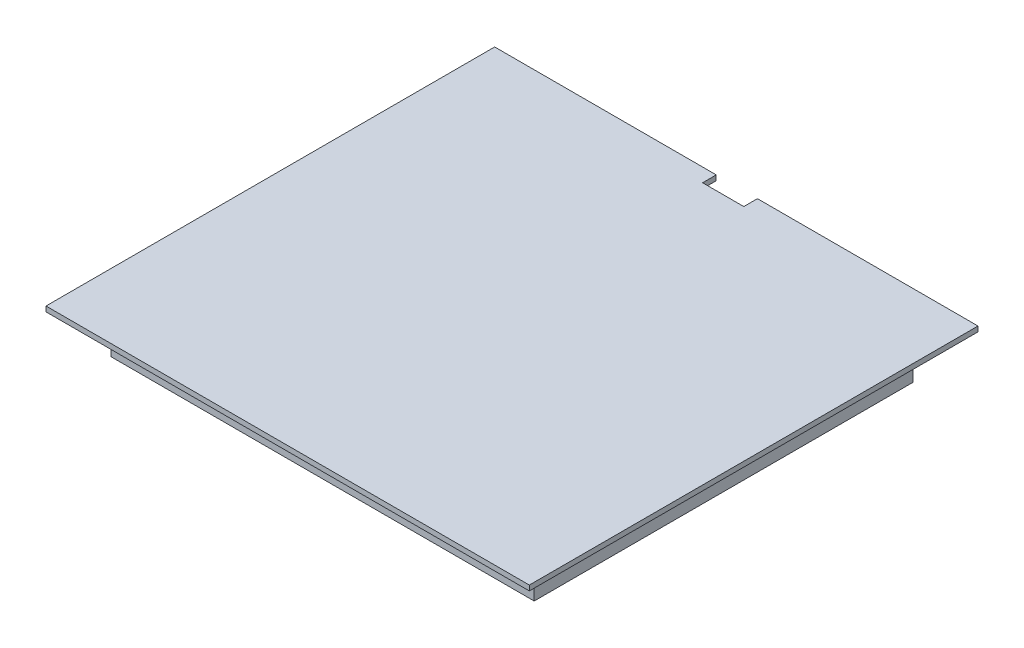
ISO-10303-21;
HEADER;
FILE_DESCRIPTION(('STEP AP214'),'2;1');
FILE_NAME('part.step','',(''),(''),'','','');
FILE_SCHEMA(('AUTOMOTIVE_DESIGN { 1 0 10303 214 1 1 1 1 }'));
ENDSEC;
DATA;
#1=APPLICATION_CONTEXT('core data for automotive mechanical design processes');
#2=APPLICATION_PROTOCOL_DEFINITION('international standard','automotive_design',2000,#1);
#3=PRODUCT_CONTEXT('',#1,'mechanical');
#4=PRODUCT('Part','Part','',(#3));
#5=PRODUCT_RELATED_PRODUCT_CATEGORY('part','',(#4));
#6=PRODUCT_DEFINITION_FORMATION('','',#4);
#7=PRODUCT_DEFINITION_CONTEXT('part definition',#1,'design');
#8=PRODUCT_DEFINITION('design','',#6,#7);
#9=PRODUCT_DEFINITION_SHAPE('','',#8);
#10=(LENGTH_UNIT() NAMED_UNIT(*) SI_UNIT(.MILLI.,.METRE.));
#11=(NAMED_UNIT(*) PLANE_ANGLE_UNIT() SI_UNIT($,.RADIAN.));
#12=(NAMED_UNIT(*) SI_UNIT($,.STERADIAN.) SOLID_ANGLE_UNIT());
#13=UNCERTAINTY_MEASURE_WITH_UNIT(LENGTH_MEASURE(1.E-05),#10,'distance_accuracy_value','');
#14=(GEOMETRIC_REPRESENTATION_CONTEXT(3) GLOBAL_UNCERTAINTY_ASSIGNED_CONTEXT((#13)) GLOBAL_UNIT_ASSIGNED_CONTEXT((#10,
#11,#12)) REPRESENTATION_CONTEXT('',''));
#15=CARTESIAN_POINT('',(0.,0.,0.));
#16=DIRECTION('',(0.,0.,1.));
#17=DIRECTION('',(1.,0.,0.));
#18=AXIS2_PLACEMENT_3D('',#15,#16,#17);
#19=CARTESIAN_POINT('',(-32.5832733447217,-6.35,-29.1673675004266));
#20=DIRECTION('',(1.,0.,0.));
#21=DIRECTION('',(0.,0.,-1.));
#22=AXIS2_PLACEMENT_3D('',#19,#20,#21);
#23=PLANE('',#22);
#24=DIRECTION('',(0.,0.,-1.));
#25=VECTOR('',#24,1.);
#26=CARTESIAN_POINT('',(-32.5832733447217,0.,-29.1673675004266));
#27=LINE('',#26,#25);
#28=CARTESIAN_POINT('',(-32.5832733447217,0.,29.1673675004266));
#29=VERTEX_POINT('',#28);
#30=CARTESIAN_POINT('',(-32.5832733447217,0.,-29.1673675004266));
#31=VERTEX_POINT('',#30);
#32=EDGE_CURVE('E107',#29,#31,#27,.T.);
#33=ORIENTED_EDGE('',*,*,#32,.T.);
#34=DIRECTION('',(0.,1.,0.));
#35=VECTOR('',#34,1.);
#36=CARTESIAN_POINT('',(-32.5832733447217,-6.35,-29.1673675004266));
#37=LINE('',#36,#35);
#38=CARTESIAN_POINT('',(-32.5832733447217,-6.35,-29.1673675004266));
#39=VERTEX_POINT('',#38);
#40=EDGE_CURVE('E12',#39,#31,#37,.T.);
#41=ORIENTED_EDGE('',*,*,#40,.F.);
#42=DIRECTION('',(0.,0.,-1.));
#43=VECTOR('',#42,1.);
#44=CARTESIAN_POINT('',(-32.5832733447217,-6.35,-29.1673675004266));
#45=LINE('',#44,#43);
#46=CARTESIAN_POINT('',(-32.5832733447217,-6.35,29.1673675004266));
#47=VERTEX_POINT('',#46);
#48=EDGE_CURVE('E95',#47,#39,#45,.T.);
#49=ORIENTED_EDGE('',*,*,#48,.F.);
#50=DIRECTION('',(0.,1.,0.));
#51=VECTOR('',#50,1.);
#52=CARTESIAN_POINT('',(-32.5832733447217,-6.35,29.1673675004266));
#53=LINE('',#52,#51);
#54=EDGE_CURVE('E103',#47,#29,#53,.T.);
#55=ORIENTED_EDGE('',*,*,#54,.T.);
#56=EDGE_LOOP('',(#33,#41,#49,#55));
#57=FACE_BOUND('',#56,.T.);
#58=ADVANCED_FACE('F44',(#57),#23,.F.);
#59=CARTESIAN_POINT('',(32.5832733447217,-6.35,-29.1673675004266));
#60=DIRECTION('',(0.,0.,1.));
#61=DIRECTION('',(1.,0.,0.));
#62=AXIS2_PLACEMENT_3D('',#59,#60,#61);
#63=PLANE('',#62);
#64=DIRECTION('',(1.,0.,0.));
#65=VECTOR('',#64,1.);
#66=CARTESIAN_POINT('',(32.5832733447217,0.,-29.1673675004266));
#67=LINE('',#66,#65);
#68=CARTESIAN_POINT('',(32.5832733447217,0.,-29.1673675004266));
#69=VERTEX_POINT('',#68);
#70=EDGE_CURVE('E99',#31,#69,#67,.T.);
#71=ORIENTED_EDGE('',*,*,#70,.T.);
#72=DIRECTION('',(0.,1.,0.));
#73=VECTOR('',#72,1.);
#74=CARTESIAN_POINT('',(32.5832733447217,-6.35,-29.1673675004266));
#75=LINE('',#74,#73);
#76=CARTESIAN_POINT('',(32.5832733447217,-6.35,-29.1673675004266));
#77=VERTEX_POINT('',#76);
#78=EDGE_CURVE('E52',#77,#69,#75,.T.);
#79=ORIENTED_EDGE('',*,*,#78,.F.);
#80=DIRECTION('',(1.,0.,0.));
#81=VECTOR('',#80,1.);
#82=CARTESIAN_POINT('',(32.5832733447217,-6.35,-29.1673675004266));
#83=LINE('',#82,#81);
#84=EDGE_CURVE('E90',#39,#77,#83,.T.);
#85=ORIENTED_EDGE('',*,*,#84,.F.);
#86=ORIENTED_EDGE('',*,*,#40,.T.);
#87=EDGE_LOOP('',(#71,#79,#85,#86));
#88=FACE_BOUND('',#87,.T.);
#89=ADVANCED_FACE('F98',(#88),#63,.F.);
#90=CARTESIAN_POINT('',(32.5832733447217,-6.35,-29.1673675004266));
#91=DIRECTION('',(-1.,0.,0.));
#92=DIRECTION('',(0.,0.,1.));
#93=AXIS2_PLACEMENT_3D('',#90,#91,#92);
#94=PLANE('',#93);
#95=DIRECTION('',(0.,0.,1.));
#96=VECTOR('',#95,1.);
#97=CARTESIAN_POINT('',(32.5832733447217,0.,-29.1673675004266));
#98=LINE('',#97,#96);
#99=CARTESIAN_POINT('',(32.5832733447217,0.,29.1673675004266));
#100=VERTEX_POINT('',#99);
#101=EDGE_CURVE('E77',#69,#100,#98,.T.);
#102=ORIENTED_EDGE('',*,*,#101,.T.);
#103=DIRECTION('',(0.,1.,0.));
#104=VECTOR('',#103,1.);
#105=CARTESIAN_POINT('',(32.5832733447217,-6.35,29.1673675004266));
#106=LINE('',#105,#104);
#107=CARTESIAN_POINT('',(32.5832733447217,-6.35,29.1673675004266));
#108=VERTEX_POINT('',#107);
#109=EDGE_CURVE('E100',#108,#100,#106,.T.);
#110=ORIENTED_EDGE('',*,*,#109,.F.);
#111=DIRECTION('',(0.,0.,1.));
#112=VECTOR('',#111,1.);
#113=CARTESIAN_POINT('',(32.5832733447217,-6.35,-29.1673675004266));
#114=LINE('',#113,#112);
#115=EDGE_CURVE('E93',#77,#108,#114,.T.);
#116=ORIENTED_EDGE('',*,*,#115,.F.);
#117=ORIENTED_EDGE('',*,*,#78,.T.);
#118=EDGE_LOOP('',(#102,#110,#116,#117));
#119=FACE_BOUND('',#118,.T.);
#120=ADVANCED_FACE('F101',(#119),#94,.F.);
#121=CARTESIAN_POINT('',(32.5832733447217,-6.35,29.1673675004266));
#122=DIRECTION('',(0.,0.,-1.));
#123=DIRECTION('',(-1.,0.,0.));
#124=AXIS2_PLACEMENT_3D('',#121,#122,#123);
#125=PLANE('',#124);
#126=DIRECTION('',(-1.,0.,0.));
#127=VECTOR('',#126,1.);
#128=CARTESIAN_POINT('',(32.5832733447217,0.,29.1673675004266));
#129=LINE('',#128,#127);
#130=EDGE_CURVE('E83',#100,#29,#129,.T.);
#131=ORIENTED_EDGE('',*,*,#130,.T.);
#132=ORIENTED_EDGE('',*,*,#54,.F.);
#133=DIRECTION('',(-1.,0.,0.));
#134=VECTOR('',#133,1.);
#135=CARTESIAN_POINT('',(32.5832733447217,-6.35,29.1673675004266));
#136=LINE('',#135,#134);
#137=EDGE_CURVE('E60',#108,#47,#136,.T.);
#138=ORIENTED_EDGE('',*,*,#137,.F.);
#139=ORIENTED_EDGE('',*,*,#109,.T.);
#140=EDGE_LOOP('',(#131,#132,#138,#139));
#141=FACE_BOUND('',#140,.T.);
#142=ADVANCED_FACE('F114',(#141),#125,.F.);
#143=CARTESIAN_POINT('',(0.,-6.35,0.));
#144=DIRECTION('',(0.,-1.,0.));
#145=DIRECTION('',(0.,0.,-1.));
#146=AXIS2_PLACEMENT_3D('',#143,#144,#145);
#147=PLANE('',#146);
#148=ORIENTED_EDGE('',*,*,#48,.T.);
#149=ORIENTED_EDGE('',*,*,#84,.T.);
#150=ORIENTED_EDGE('',*,*,#115,.T.);
#151=ORIENTED_EDGE('',*,*,#137,.T.);
#152=EDGE_LOOP('',(#148,#149,#150,#151));
#153=FACE_BOUND('',#152,.T.);
#154=ADVANCED_FACE('F91',(#153),#147,.T.);
#155=CARTESIAN_POINT('',(0.,0.,0.));
#156=DIRECTION('',(0.,-1.,0.));
#157=DIRECTION('',(0.,0.,-1.));
#158=AXIS2_PLACEMENT_3D('',#155,#156,#157);
#159=PLANE('',#158);
#160=ORIENTED_EDGE('',*,*,#32,.F.);
#161=ORIENTED_EDGE('',*,*,#130,.F.);
#162=ORIENTED_EDGE('',*,*,#101,.F.);
#163=ORIENTED_EDGE('',*,*,#70,.F.);
#164=EDGE_LOOP('',(#160,#161,#162,#163));
#165=FACE_BOUND('',#164,.T.);
#166=ADVANCED_FACE('F117',(#165),#159,.F.);
#167=CLOSED_SHELL('',(#58,#89,#120,#142,#154,#166));
#168=MANIFOLD_SOLID_BREP('B2',#167);
#169=CARTESIAN_POINT('',(37.211,0.7874,-34.544));
#170=DIRECTION('',(0.,0.,1.));
#171=DIRECTION('',(1.,0.,0.));
#172=AXIS2_PLACEMENT_3D('',#169,#170,#171);
#173=PLANE('',#172);
#174=DIRECTION('',(-1.,0.,0.));
#175=VECTOR('',#174,1.);
#176=CARTESIAN_POINT('',(37.211,0.7874,-34.544));
#177=LINE('',#176,#175);
#178=CARTESIAN_POINT('',(-3.09421520034433,0.7874,-34.544));
#179=VERTEX_POINT('',#178);
#180=CARTESIAN_POINT('',(-37.211,0.7874,-34.544));
#181=VERTEX_POINT('',#180);
#182=EDGE_CURVE('E191',#179,#181,#177,.T.);
#183=ORIENTED_EDGE('',*,*,#182,.F.);
#184=DIRECTION('',(0.,1.,0.));
#185=VECTOR('',#184,1.);
#186=CARTESIAN_POINT('',(-3.09421520034433,-5.5626,-34.544));
#187=LINE('',#186,#185);
#188=CARTESIAN_POINT('',(-3.09421520034433,0.,-34.544));
#189=VERTEX_POINT('',#188);
#190=EDGE_CURVE('E254',#189,#179,#187,.T.);
#191=ORIENTED_EDGE('',*,*,#190,.F.);
#192=DIRECTION('',(-1.,0.,0.));
#193=VECTOR('',#192,1.);
#194=CARTESIAN_POINT('',(37.211,0.,-34.544));
#195=LINE('',#194,#193);
#196=CARTESIAN_POINT('',(-37.211,0.,-34.544));
#197=VERTEX_POINT('',#196);
#198=EDGE_CURVE('E213',#189,#197,#195,.T.);
#199=ORIENTED_EDGE('',*,*,#198,.T.);
#200=DIRECTION('',(0.,-1.,0.));
#201=VECTOR('',#200,1.);
#202=CARTESIAN_POINT('',(-37.211,0.7874,-34.544));
#203=LINE('',#202,#201);
#204=EDGE_CURVE('E275',#181,#197,#203,.T.);
#205=ORIENTED_EDGE('',*,*,#204,.F.);
#206=EDGE_LOOP('',(#183,#191,#199,#205));
#207=FACE_BOUND('',#206,.T.);
#208=ADVANCED_FACE('F167',(#207),#173,.F.);
#209=CARTESIAN_POINT('',(-37.211,0.7874,34.544));
#210=DIRECTION('',(1.,0.,0.));
#211=DIRECTION('',(0.,0.,-1.));
#212=AXIS2_PLACEMENT_3D('',#209,#210,#211);
#213=PLANE('',#212);
#214=DIRECTION('',(0.,0.,1.));
#215=VECTOR('',#214,1.);
#216=CARTESIAN_POINT('',(-37.211,0.,34.544));
#217=LINE('',#216,#215);
#218=CARTESIAN_POINT('',(-37.211,0.,34.544));
#219=VERTEX_POINT('',#218);
#220=EDGE_CURVE('E262',#197,#219,#217,.T.);
#221=ORIENTED_EDGE('',*,*,#220,.T.);
#222=DIRECTION('',(0.,-1.,0.));
#223=VECTOR('',#222,1.);
#224=CARTESIAN_POINT('',(-37.211,0.7874,34.544));
#225=LINE('',#224,#223);
#226=CARTESIAN_POINT('',(-37.211,0.7874,34.544));
#227=VERTEX_POINT('',#226);
#228=EDGE_CURVE('E291',#227,#219,#225,.T.);
#229=ORIENTED_EDGE('',*,*,#228,.F.);
#230=DIRECTION('',(0.,0.,1.));
#231=VECTOR('',#230,1.);
#232=CARTESIAN_POINT('',(-37.211,0.7874,34.544));
#233=LINE('',#232,#231);
#234=EDGE_CURVE('E267',#181,#227,#233,.T.);
#235=ORIENTED_EDGE('',*,*,#234,.F.);
#236=ORIENTED_EDGE('',*,*,#204,.T.);
#237=EDGE_LOOP('',(#221,#229,#235,#236));
#238=FACE_BOUND('',#237,.T.);
#239=ADVANCED_FACE('F169',(#238),#213,.F.);
#240=CARTESIAN_POINT('',(37.211,0.7874,34.544));
#241=DIRECTION('',(0.,0.,-1.));
#242=DIRECTION('',(-1.,0.,0.));
#243=AXIS2_PLACEMENT_3D('',#240,#241,#242);
#244=PLANE('',#243);
#245=DIRECTION('',(1.,0.,0.));
#246=VECTOR('',#245,1.);
#247=CARTESIAN_POINT('',(37.211,0.,34.544));
#248=LINE('',#247,#246);
#249=CARTESIAN_POINT('',(37.211,0.,34.544));
#250=VERTEX_POINT('',#249);
#251=EDGE_CURVE('E278',#219,#250,#248,.T.);
#252=ORIENTED_EDGE('',*,*,#251,.T.);
#253=DIRECTION('',(0.,-1.,0.));
#254=VECTOR('',#253,1.);
#255=CARTESIAN_POINT('',(37.211,0.7874,34.544));
#256=LINE('',#255,#254);
#257=CARTESIAN_POINT('',(37.211,0.7874,34.544));
#258=VERTEX_POINT('',#257);
#259=EDGE_CURVE('E288',#258,#250,#256,.T.);
#260=ORIENTED_EDGE('',*,*,#259,.F.);
#261=DIRECTION('',(1.,0.,0.));
#262=VECTOR('',#261,1.);
#263=CARTESIAN_POINT('',(37.211,0.7874,34.544));
#264=LINE('',#263,#262);
#265=EDGE_CURVE('E221',#227,#258,#264,.T.);
#266=ORIENTED_EDGE('',*,*,#265,.F.);
#267=ORIENTED_EDGE('',*,*,#228,.T.);
#268=EDGE_LOOP('',(#252,#260,#266,#267));
#269=FACE_BOUND('',#268,.T.);
#270=ADVANCED_FACE('F308',(#269),#244,.F.);
#271=CARTESIAN_POINT('',(37.211,0.7874,34.544));
#272=DIRECTION('',(-1.,0.,0.));
#273=DIRECTION('',(0.,0.,1.));
#274=AXIS2_PLACEMENT_3D('',#271,#272,#273);
#275=PLANE('',#274);
#276=DIRECTION('',(0.,0.,-1.));
#277=VECTOR('',#276,1.);
#278=CARTESIAN_POINT('',(37.211,0.,34.544));
#279=LINE('',#278,#277);
#280=CARTESIAN_POINT('',(37.211,0.,-34.544));
#281=VERTEX_POINT('',#280);
#282=EDGE_CURVE('E280',#250,#281,#279,.T.);
#283=ORIENTED_EDGE('',*,*,#282,.T.);
#284=DIRECTION('',(0.,-1.,0.));
#285=VECTOR('',#284,1.);
#286=CARTESIAN_POINT('',(37.211,0.7874,-34.544));
#287=LINE('',#286,#285);
#288=CARTESIAN_POINT('',(37.211,0.7874,-34.544));
#289=VERTEX_POINT('',#288);
#290=EDGE_CURVE('E285',#289,#281,#287,.T.);
#291=ORIENTED_EDGE('',*,*,#290,.F.);
#292=DIRECTION('',(0.,0.,-1.));
#293=VECTOR('',#292,1.);
#294=CARTESIAN_POINT('',(37.211,0.7874,34.544));
#295=LINE('',#294,#293);
#296=EDGE_CURVE('E271',#258,#289,#295,.T.);
#297=ORIENTED_EDGE('',*,*,#296,.F.);
#298=ORIENTED_EDGE('',*,*,#259,.T.);
#299=EDGE_LOOP('',(#283,#291,#297,#298));
#300=FACE_BOUND('',#299,.T.);
#301=ADVANCED_FACE('F305',(#300),#275,.F.);
#302=CARTESIAN_POINT('',(3.25029074388172,0.,-34.544));
#303=VERTEX_POINT('',#302);
#304=EDGE_CURVE('E269',#281,#303,#195,.T.);
#305=ORIENTED_EDGE('',*,*,#304,.T.);
#306=DIRECTION('',(0.,1.,0.));
#307=VECTOR('',#306,1.);
#308=CARTESIAN_POINT('',(3.25029074388172,-5.5626,-34.544));
#309=LINE('',#308,#307);
#310=CARTESIAN_POINT('',(3.25029074388172,0.7874,-34.544));
#311=VERTEX_POINT('',#310);
#312=EDGE_CURVE('E263',#303,#311,#309,.T.);
#313=ORIENTED_EDGE('',*,*,#312,.T.);
#314=EDGE_CURVE('E273',#289,#311,#177,.T.);
#315=ORIENTED_EDGE('',*,*,#314,.F.);
#316=ORIENTED_EDGE('',*,*,#290,.T.);
#317=EDGE_LOOP('',(#305,#313,#315,#316));
#318=FACE_BOUND('',#317,.T.);
#319=ADVANCED_FACE('F300',(#318),#173,.F.);
#320=CARTESIAN_POINT('',(0.,0.7874,0.));
#321=DIRECTION('',(0.,1.,0.));
#322=DIRECTION('',(0.,0.,1.));
#323=AXIS2_PLACEMENT_3D('',#320,#321,#322);
#324=PLANE('',#323);
#325=DIRECTION('',(0.,0.,1.));
#326=VECTOR('',#325,1.);
#327=CARTESIAN_POINT('',(-3.09421520034433,0.7874,-34.544));
#328=LINE('',#327,#326);
#329=CARTESIAN_POINT('',(-3.09421520034433,0.7874,-32.4401497199591));
#330=VERTEX_POINT('',#329);
#331=EDGE_CURVE('E252',#179,#330,#328,.T.);
#332=ORIENTED_EDGE('',*,*,#331,.F.);
#333=ORIENTED_EDGE('',*,*,#182,.T.);
#334=ORIENTED_EDGE('',*,*,#234,.T.);
#335=ORIENTED_EDGE('',*,*,#265,.T.);
#336=ORIENTED_EDGE('',*,*,#296,.T.);
#337=ORIENTED_EDGE('',*,*,#314,.T.);
#338=DIRECTION('',(0.,0.,-1.));
#339=VECTOR('',#338,1.);
#340=CARTESIAN_POINT('',(3.25029074388172,0.7874,-34.544));
#341=LINE('',#340,#339);
#342=CARTESIAN_POINT('',(3.25029074388172,0.7874,-32.4401497199591));
#343=VERTEX_POINT('',#342);
#344=EDGE_CURVE('E250',#343,#311,#341,.T.);
#345=ORIENTED_EDGE('',*,*,#344,.F.);
#346=DIRECTION('',(1.,0.,0.));
#347=VECTOR('',#346,1.);
#348=CARTESIAN_POINT('',(-3.09421520034433,0.7874,-32.4401497199591));
#349=LINE('',#348,#347);
#350=EDGE_CURVE('E245',#330,#343,#349,.T.);
#351=ORIENTED_EDGE('',*,*,#350,.F.);
#352=EDGE_LOOP('',(#332,#333,#334,#335,#336,#337,#345,#351));
#353=FACE_BOUND('',#352,.T.);
#354=ADVANCED_FACE('F256',(#353),#324,.T.);
#355=CARTESIAN_POINT('',(0.,0.,0.));
#356=DIRECTION('',(0.,1.,0.));
#357=DIRECTION('',(0.,0.,1.));
#358=AXIS2_PLACEMENT_3D('',#355,#356,#357);
#359=PLANE('',#358);
#360=ORIENTED_EDGE('',*,*,#198,.F.);
#361=DIRECTION('',(0.,0.,1.));
#362=VECTOR('',#361,1.);
#363=CARTESIAN_POINT('',(-3.09421520034433,0.,0.));
#364=LINE('',#363,#362);
#365=CARTESIAN_POINT('',(-3.09421520034433,0.,-32.4401497199591));
#366=VERTEX_POINT('',#365);
#367=EDGE_CURVE('E42',#189,#366,#364,.T.);
#368=ORIENTED_EDGE('',*,*,#367,.T.);
#369=DIRECTION('',(1.,0.,0.));
#370=VECTOR('',#369,1.);
#371=CARTESIAN_POINT('',(0.,0.,-32.4401497199591));
#372=LINE('',#371,#370);
#373=CARTESIAN_POINT('',(3.25029074388172,0.,-32.4401497199591));
#374=VERTEX_POINT('',#373);
#375=EDGE_CURVE('E248',#366,#374,#372,.T.);
#376=ORIENTED_EDGE('',*,*,#375,.T.);
#377=DIRECTION('',(0.,0.,-1.));
#378=VECTOR('',#377,1.);
#379=CARTESIAN_POINT('',(3.25029074388172,0.,0.));
#380=LINE('',#379,#378);
#381=EDGE_CURVE('E175',#374,#303,#380,.T.);
#382=ORIENTED_EDGE('',*,*,#381,.T.);
#383=ORIENTED_EDGE('',*,*,#304,.F.);
#384=ORIENTED_EDGE('',*,*,#282,.F.);
#385=ORIENTED_EDGE('',*,*,#251,.F.);
#386=ORIENTED_EDGE('',*,*,#220,.F.);
#387=EDGE_LOOP('',(#360,#368,#376,#382,#383,#384,#385,#386));
#388=FACE_BOUND('',#387,.T.);
#389=ADVANCED_FACE('F296',(#388),#359,.F.);
#390=CARTESIAN_POINT('',(-3.09421520034433,-5.5626,-34.544));
#391=DIRECTION('',(-1.,0.,0.));
#392=DIRECTION('',(0.,0.,1.));
#393=AXIS2_PLACEMENT_3D('',#390,#391,#392);
#394=PLANE('',#393);
#395=ORIENTED_EDGE('',*,*,#190,.T.);
#396=ORIENTED_EDGE('',*,*,#331,.T.);
#397=DIRECTION('',(0.,1.,0.));
#398=VECTOR('',#397,1.);
#399=CARTESIAN_POINT('',(-3.09421520034433,-5.5626,-32.4401497199591));
#400=LINE('',#399,#398);
#401=EDGE_CURVE('E241',#366,#330,#400,.T.);
#402=ORIENTED_EDGE('',*,*,#401,.F.);
#403=ORIENTED_EDGE('',*,*,#367,.F.);
#404=EDGE_LOOP('',(#395,#396,#402,#403));
#405=FACE_BOUND('',#404,.T.);
#406=ADVANCED_FACE('F253',(#405),#394,.F.);
#407=CARTESIAN_POINT('',(3.25029074388172,-5.5626,-34.544));
#408=DIRECTION('',(1.,0.,0.));
#409=DIRECTION('',(0.,0.,-1.));
#410=AXIS2_PLACEMENT_3D('',#407,#408,#409);
#411=PLANE('',#410);
#412=DIRECTION('',(0.,1.,0.));
#413=VECTOR('',#412,1.);
#414=CARTESIAN_POINT('',(3.25029074388172,-5.5626,-32.4401497199591));
#415=LINE('',#414,#413);
#416=EDGE_CURVE('E182',#374,#343,#415,.T.);
#417=ORIENTED_EDGE('',*,*,#416,.T.);
#418=ORIENTED_EDGE('',*,*,#344,.T.);
#419=ORIENTED_EDGE('',*,*,#312,.F.);
#420=ORIENTED_EDGE('',*,*,#381,.F.);
#421=EDGE_LOOP('',(#417,#418,#419,#420));
#422=FACE_BOUND('',#421,.T.);
#423=ADVANCED_FACE('F368',(#422),#411,.F.);
#424=CARTESIAN_POINT('',(-3.09421520034433,-5.5626,-32.4401497199591));
#425=DIRECTION('',(0.,0.,1.));
#426=DIRECTION('',(1.,0.,0.));
#427=AXIS2_PLACEMENT_3D('',#424,#425,#426);
#428=PLANE('',#427);
#429=ORIENTED_EDGE('',*,*,#401,.T.);
#430=ORIENTED_EDGE('',*,*,#350,.T.);
#431=ORIENTED_EDGE('',*,*,#416,.F.);
#432=ORIENTED_EDGE('',*,*,#375,.F.);
#433=EDGE_LOOP('',(#429,#430,#431,#432));
#434=FACE_BOUND('',#433,.T.);
#435=ADVANCED_FACE('F243',(#434),#428,.F.);
#436=CLOSED_SHELL('',(#208,#239,#270,#301,#319,#354,#389,#406,#423,#435));
#437=MANIFOLD_SOLID_BREP('B6',#436);
#438=ADVANCED_BREP_SHAPE_REPRESENTATION('',(#18,#168,#437),#14);
#439=SHAPE_DEFINITION_REPRESENTATION(#9,#438);
ENDSEC;
END-ISO-10303-21;
